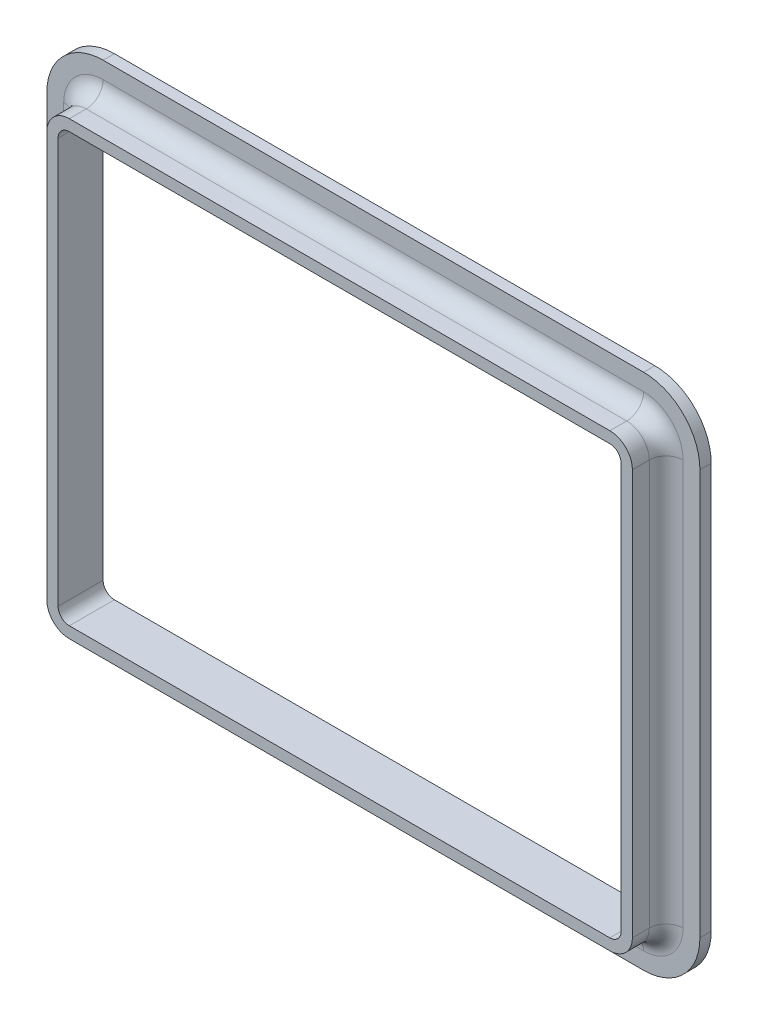
ISO-10303-21;
HEADER;
FILE_DESCRIPTION(('STEP AP214'),'2;1');
FILE_NAME('part.step','',(''),(''),'','','');
FILE_SCHEMA(('AUTOMOTIVE_DESIGN { 1 0 10303 214 1 1 1 1 }'));
ENDSEC;
DATA;
#1=APPLICATION_CONTEXT('core data for automotive mechanical design processes');
#2=APPLICATION_PROTOCOL_DEFINITION('international standard','automotive_design',2000,#1);
#3=PRODUCT_CONTEXT('',#1,'mechanical');
#4=PRODUCT('Part','Part','',(#3));
#5=PRODUCT_RELATED_PRODUCT_CATEGORY('part','',(#4));
#6=PRODUCT_DEFINITION_FORMATION('','',#4);
#7=PRODUCT_DEFINITION_CONTEXT('part definition',#1,'design');
#8=PRODUCT_DEFINITION('design','',#6,#7);
#9=PRODUCT_DEFINITION_SHAPE('','',#8);
#10=(LENGTH_UNIT() NAMED_UNIT(*) SI_UNIT(.MILLI.,.METRE.));
#11=(NAMED_UNIT(*) PLANE_ANGLE_UNIT() SI_UNIT($,.RADIAN.));
#12=(NAMED_UNIT(*) SI_UNIT($,.STERADIAN.) SOLID_ANGLE_UNIT());
#13=UNCERTAINTY_MEASURE_WITH_UNIT(LENGTH_MEASURE(1.E-05),#10,'distance_accuracy_value','');
#14=(GEOMETRIC_REPRESENTATION_CONTEXT(3) GLOBAL_UNCERTAINTY_ASSIGNED_CONTEXT((#13)) GLOBAL_UNIT_ASSIGNED_CONTEXT((#10,
#11,#12)) REPRESENTATION_CONTEXT('',''));
#15=CARTESIAN_POINT('',(0.,0.,0.));
#16=DIRECTION('',(0.,0.,1.));
#17=DIRECTION('',(1.,0.,0.));
#18=AXIS2_PLACEMENT_3D('',#15,#16,#17);
#19=CARTESIAN_POINT('',(-1.3,0.,0.6));
#20=DIRECTION('',(-1.,0.,0.));
#21=DIRECTION('',(0.,1.,0.));
#22=AXIS2_PLACEMENT_3D('',#19,#20,#21);
#23=PLANE('',#22);
#24=DIRECTION('',(0.,-1.,0.));
#25=VECTOR('',#24,1.);
#26=CARTESIAN_POINT('',(-1.3,0.,0.525));
#27=LINE('',#26,#25);
#28=CARTESIAN_POINT('',(-1.3,0.9,0.525));
#29=VERTEX_POINT('',#28);
#30=CARTESIAN_POINT('',(-1.3,-0.9,0.525));
#31=VERTEX_POINT('',#30);
#32=EDGE_CURVE('E11',#29,#31,#27,.T.);
#33=ORIENTED_EDGE('',*,*,#32,.T.);
#34=DIRECTION('',(0.,0.,-1.));
#35=VECTOR('',#34,1.);
#36=CARTESIAN_POINT('',(-1.3,-0.9,0.525));
#37=LINE('',#36,#35);
#38=CARTESIAN_POINT('',(-1.3,-0.9,0.6));
#39=VERTEX_POINT('',#38);
#40=EDGE_CURVE('E27',#39,#31,#37,.T.);
#41=ORIENTED_EDGE('',*,*,#40,.F.);
#42=DIRECTION('',(0.,-1.,0.));
#43=VECTOR('',#42,1.);
#44=CARTESIAN_POINT('',(-1.3,0.9,0.6));
#45=LINE('',#44,#43);
#46=CARTESIAN_POINT('',(-1.3,0.9,0.6));
#47=VERTEX_POINT('',#46);
#48=EDGE_CURVE('E437',#47,#39,#45,.T.);
#49=ORIENTED_EDGE('',*,*,#48,.F.);
#50=DIRECTION('',(0.,0.,-1.));
#51=VECTOR('',#50,1.);
#52=CARTESIAN_POINT('',(-1.3,0.9,0.525));
#53=LINE('',#52,#51);
#54=EDGE_CURVE('E286',#47,#29,#53,.T.);
#55=ORIENTED_EDGE('',*,*,#54,.T.);
#56=EDGE_LOOP('',(#33,#41,#49,#55));
#57=FACE_BOUND('',#56,.T.);
#58=ADVANCED_FACE('F16',(#57),#23,.T.);
#59=CARTESIAN_POINT('',(-1.375,0.,0.525));
#60=DIRECTION('',(0.,-1.,0.));
#61=DIRECTION('',(1.,0.,0.));
#62=AXIS2_PLACEMENT_3D('',#59,#60,#61);
#63=CYLINDRICAL_SURFACE('',#62,0.075);
#64=DIRECTION('',(0.,-1.,0.));
#65=VECTOR('',#64,1.);
#66=CARTESIAN_POINT('',(-1.375,0.9,0.45));
#67=LINE('',#66,#65);
#68=CARTESIAN_POINT('',(-1.375,0.9,0.45));
#69=VERTEX_POINT('',#68);
#70=CARTESIAN_POINT('',(-1.375,-0.9,0.45));
#71=VERTEX_POINT('',#70);
#72=EDGE_CURVE('E402',#69,#71,#67,.T.);
#73=ORIENTED_EDGE('',*,*,#72,.T.);
#74=CARTESIAN_POINT('',(-1.375,-0.9,0.525));
#75=DIRECTION('',(0.,1.,0.));
#76=DIRECTION('',(1.,0.,0.));
#77=AXIS2_PLACEMENT_3D('',#74,#75,#76);
#78=CIRCLE('',#77,0.075);
#79=EDGE_CURVE('E397',#31,#71,#78,.T.);
#80=ORIENTED_EDGE('',*,*,#79,.F.);
#81=ORIENTED_EDGE('',*,*,#32,.F.);
#82=CARTESIAN_POINT('',(-1.375,0.9,0.525));
#83=DIRECTION('',(0.,1.,0.));
#84=DIRECTION('',(1.,0.,0.));
#85=AXIS2_PLACEMENT_3D('',#82,#83,#84);
#86=CIRCLE('',#85,0.075);
#87=EDGE_CURVE('E294',#29,#69,#86,.T.);
#88=ORIENTED_EDGE('',*,*,#87,.T.);
#89=EDGE_LOOP('',(#73,#80,#81,#88));
#90=FACE_BOUND('',#89,.T.);
#91=ADVANCED_FACE('F632',(#90),#63,.F.);
#92=CARTESIAN_POINT('',(-1.45,0.,0.45));
#93=DIRECTION('',(-1.,0.,0.));
#94=DIRECTION('',(0.,1.,0.));
#95=AXIS2_PLACEMENT_3D('',#92,#93,#94);
#96=PLANE('',#95);
#97=DIRECTION('',(0.,-1.,0.));
#98=VECTOR('',#97,1.);
#99=CARTESIAN_POINT('',(-1.45,0.9,0.4));
#100=LINE('',#99,#98);
#101=CARTESIAN_POINT('',(-1.45,0.9,0.4));
#102=VERTEX_POINT('',#101);
#103=CARTESIAN_POINT('',(-1.45,-0.9,0.4));
#104=VERTEX_POINT('',#103);
#105=EDGE_CURVE('E518',#102,#104,#100,.T.);
#106=ORIENTED_EDGE('',*,*,#105,.T.);
#107=DIRECTION('',(0.,0.,-1.));
#108=VECTOR('',#107,1.);
#109=CARTESIAN_POINT('',(-1.45,-0.9,0.4));
#110=LINE('',#109,#108);
#111=CARTESIAN_POINT('',(-1.45,-0.9,0.45));
#112=VERTEX_POINT('',#111);
#113=EDGE_CURVE('E442',#112,#104,#110,.T.);
#114=ORIENTED_EDGE('',*,*,#113,.F.);
#115=DIRECTION('',(0.,-1.,0.));
#116=VECTOR('',#115,1.);
#117=CARTESIAN_POINT('',(-1.45,0.9,0.45));
#118=LINE('',#117,#116);
#119=CARTESIAN_POINT('',(-1.45,0.9,0.45));
#120=VERTEX_POINT('',#119);
#121=EDGE_CURVE('E356',#120,#112,#118,.T.);
#122=ORIENTED_EDGE('',*,*,#121,.F.);
#123=DIRECTION('',(0.,0.,-1.));
#124=VECTOR('',#123,1.);
#125=CARTESIAN_POINT('',(-1.45,0.9,0.4));
#126=LINE('',#125,#124);
#127=EDGE_CURVE('E311',#120,#102,#126,.T.);
#128=ORIENTED_EDGE('',*,*,#127,.T.);
#129=EDGE_LOOP('',(#106,#114,#122,#128));
#130=FACE_BOUND('',#129,.T.);
#131=ADVANCED_FACE('F623',(#130),#96,.T.);
#132=CARTESIAN_POINT('',(-1.25,0.,0.4));
#133=DIRECTION('',(1.,0.,0.));
#134=DIRECTION('',(0.,1.,0.));
#135=AXIS2_PLACEMENT_3D('',#132,#133,#134);
#136=PLANE('',#135);
#137=DIRECTION('',(0.,-1.,0.));
#138=VECTOR('',#137,1.);
#139=CARTESIAN_POINT('',(-1.25,0.9,0.6));
#140=LINE('',#139,#138);
#141=CARTESIAN_POINT('',(-1.25,0.9,0.6));
#142=VERTEX_POINT('',#141);
#143=CARTESIAN_POINT('',(-1.25,-0.9,0.6));
#144=VERTEX_POINT('',#143);
#145=EDGE_CURVE('E425',#142,#144,#140,.T.);
#146=ORIENTED_EDGE('',*,*,#145,.T.);
#147=DIRECTION('',(0.,0.,1.));
#148=VECTOR('',#147,1.);
#149=CARTESIAN_POINT('',(-1.25,-0.9,0.6));
#150=LINE('',#149,#148);
#151=CARTESIAN_POINT('',(-1.25,-0.9,0.4));
#152=VERTEX_POINT('',#151);
#153=EDGE_CURVE('E227',#152,#144,#150,.T.);
#154=ORIENTED_EDGE('',*,*,#153,.F.);
#155=DIRECTION('',(0.,-1.,0.));
#156=VECTOR('',#155,1.);
#157=CARTESIAN_POINT('',(-1.25,0.9,0.4));
#158=LINE('',#157,#156);
#159=CARTESIAN_POINT('',(-1.25,0.9,0.4));
#160=VERTEX_POINT('',#159);
#161=EDGE_CURVE('E390',#160,#152,#158,.T.);
#162=ORIENTED_EDGE('',*,*,#161,.F.);
#163=DIRECTION('',(0.,0.,1.));
#164=VECTOR('',#163,1.);
#165=CARTESIAN_POINT('',(-1.25,0.9,0.6));
#166=LINE('',#165,#164);
#167=EDGE_CURVE('E323',#160,#142,#166,.T.);
#168=ORIENTED_EDGE('',*,*,#167,.T.);
#169=EDGE_LOOP('',(#146,#154,#162,#168));
#170=FACE_BOUND('',#169,.T.);
#171=ADVANCED_FACE('F18',(#170),#136,.T.);
#172=CARTESIAN_POINT('',(-1.2,-0.9,0.5625));
#173=DIRECTION('',(0.,0.,1.));
#174=DIRECTION('',(-1.,0.,0.));
#175=AXIS2_PLACEMENT_3D('',#172,#173,#174);
#176=CYLINDRICAL_SURFACE('',#175,0.1);
#177=ORIENTED_EDGE('',*,*,#40,.T.);
#178=CARTESIAN_POINT('',(-1.2,-0.9,0.525));
#179=DIRECTION('',(0.,0.,1.));
#180=DIRECTION('',(-1.,0.,0.));
#181=AXIS2_PLACEMENT_3D('',#178,#179,#180);
#182=CIRCLE('',#181,0.1);
#183=CARTESIAN_POINT('',(-1.2,-1.,0.525));
#184=VERTEX_POINT('',#183);
#185=EDGE_CURVE('E359',#31,#184,#182,.T.);
#186=ORIENTED_EDGE('',*,*,#185,.T.);
#187=DIRECTION('',(0.,0.,-1.));
#188=VECTOR('',#187,1.);
#189=CARTESIAN_POINT('',(-1.2,-1.,0.525));
#190=LINE('',#189,#188);
#191=CARTESIAN_POINT('',(-1.2,-1.,0.6));
#192=VERTEX_POINT('',#191);
#193=EDGE_CURVE('E449',#192,#184,#190,.T.);
#194=ORIENTED_EDGE('',*,*,#193,.F.);
#195=CARTESIAN_POINT('',(-1.2,-0.9,0.6));
#196=DIRECTION('',(0.,0.,1.));
#197=DIRECTION('',(-1.,0.,0.));
#198=AXIS2_PLACEMENT_3D('',#195,#196,#197);
#199=CIRCLE('',#198,0.1);
#200=EDGE_CURVE('E433',#39,#192,#199,.T.);
#201=ORIENTED_EDGE('',*,*,#200,.F.);
#202=EDGE_LOOP('',(#177,#186,#194,#201));
#203=FACE_BOUND('',#202,.T.);
#204=ADVANCED_FACE('F622',(#203),#176,.T.);
#205=CARTESIAN_POINT('',(-1.2,-0.9,0.525));
#206=DIRECTION('',(0.,0.,1.));
#207=DIRECTION('',(1.,0.,0.));
#208=AXIS2_PLACEMENT_3D('',#205,#206,#207);
#209=TOROIDAL_SURFACE('',#208,0.175,0.075);
#210=ORIENTED_EDGE('',*,*,#79,.T.);
#211=CARTESIAN_POINT('',(-1.2,-0.9,0.45));
#212=DIRECTION('',(0.,0.,1.));
#213=DIRECTION('',(-1.,0.,0.));
#214=AXIS2_PLACEMENT_3D('',#211,#212,#213);
#215=CIRCLE('',#214,0.175);
#216=CARTESIAN_POINT('',(-1.2,-1.075,0.45));
#217=VERTEX_POINT('',#216);
#218=EDGE_CURVE('E355',#71,#217,#215,.T.);
#219=ORIENTED_EDGE('',*,*,#218,.T.);
#220=CARTESIAN_POINT('',(-1.2,-1.075,0.525));
#221=DIRECTION('',(-1.,0.,0.));
#222=DIRECTION('',(0.,1.,0.));
#223=AXIS2_PLACEMENT_3D('',#220,#221,#222);
#224=CIRCLE('',#223,0.075);
#225=EDGE_CURVE('E315',#184,#217,#224,.T.);
#226=ORIENTED_EDGE('',*,*,#225,.F.);
#227=ORIENTED_EDGE('',*,*,#185,.F.);
#228=EDGE_LOOP('',(#210,#219,#226,#227));
#229=FACE_BOUND('',#228,.T.);
#230=ADVANCED_FACE('F629',(#229),#209,.F.);
#231=CARTESIAN_POINT('',(-1.2,-0.9,0.425));
#232=DIRECTION('',(0.,0.,1.));
#233=DIRECTION('',(-1.,0.,0.));
#234=AXIS2_PLACEMENT_3D('',#231,#232,#233);
#235=CYLINDRICAL_SURFACE('',#234,0.25);
#236=ORIENTED_EDGE('',*,*,#113,.T.);
#237=CARTESIAN_POINT('',(-1.2,-0.9,0.4));
#238=DIRECTION('',(0.,0.,1.));
#239=DIRECTION('',(-1.,0.,0.));
#240=AXIS2_PLACEMENT_3D('',#237,#238,#239);
#241=CIRCLE('',#240,0.25);
#242=CARTESIAN_POINT('',(-1.2,-1.15,0.4));
#243=VERTEX_POINT('',#242);
#244=EDGE_CURVE('E522',#104,#243,#241,.T.);
#245=ORIENTED_EDGE('',*,*,#244,.T.);
#246=DIRECTION('',(0.,0.,-1.));
#247=VECTOR('',#246,1.);
#248=CARTESIAN_POINT('',(-1.2,-1.15,0.4));
#249=LINE('',#248,#247);
#250=CARTESIAN_POINT('',(-1.2,-1.15,0.45));
#251=VERTEX_POINT('',#250);
#252=EDGE_CURVE('E217',#251,#243,#249,.T.);
#253=ORIENTED_EDGE('',*,*,#252,.F.);
#254=CARTESIAN_POINT('',(-1.2,-0.9,0.45));
#255=DIRECTION('',(0.,0.,1.));
#256=DIRECTION('',(-1.,0.,0.));
#257=AXIS2_PLACEMENT_3D('',#254,#255,#256);
#258=CIRCLE('',#257,0.25);
#259=EDGE_CURVE('E352',#112,#251,#258,.T.);
#260=ORIENTED_EDGE('',*,*,#259,.F.);
#261=EDGE_LOOP('',(#236,#245,#253,#260));
#262=FACE_BOUND('',#261,.T.);
#263=ADVANCED_FACE('F643',(#262),#235,.T.);
#264=CARTESIAN_POINT('',(-1.2,-0.9,0.5));
#265=DIRECTION('',(0.,0.,1.));
#266=DIRECTION('',(-1.,0.,0.));
#267=AXIS2_PLACEMENT_3D('',#264,#265,#266);
#268=CYLINDRICAL_SURFACE('',#267,0.05);
#269=ORIENTED_EDGE('',*,*,#153,.T.);
#270=CARTESIAN_POINT('',(-1.2,-0.9,0.6));
#271=DIRECTION('',(0.,0.,1.));
#272=DIRECTION('',(-1.,0.,0.));
#273=AXIS2_PLACEMENT_3D('',#270,#271,#272);
#274=CIRCLE('',#273,0.05);
#275=CARTESIAN_POINT('',(-1.2,-0.95,0.6));
#276=VERTEX_POINT('',#275);
#277=EDGE_CURVE('E428',#144,#276,#274,.T.);
#278=ORIENTED_EDGE('',*,*,#277,.T.);
#279=DIRECTION('',(0.,0.,1.));
#280=VECTOR('',#279,1.);
#281=CARTESIAN_POINT('',(-1.2,-0.95,0.6));
#282=LINE('',#281,#280);
#283=CARTESIAN_POINT('',(-1.2,-0.95,0.4));
#284=VERTEX_POINT('',#283);
#285=EDGE_CURVE('E338',#284,#276,#282,.T.);
#286=ORIENTED_EDGE('',*,*,#285,.F.);
#287=CARTESIAN_POINT('',(-1.2,-0.9,0.4));
#288=DIRECTION('',(0.,0.,1.));
#289=DIRECTION('',(-1.,0.,0.));
#290=AXIS2_PLACEMENT_3D('',#287,#288,#289);
#291=CIRCLE('',#290,0.05);
#292=EDGE_CURVE('E345',#152,#284,#291,.T.);
#293=ORIENTED_EDGE('',*,*,#292,.F.);
#294=EDGE_LOOP('',(#269,#278,#286,#293));
#295=FACE_BOUND('',#294,.T.);
#296=ADVANCED_FACE('F596',(#295),#268,.F.);
#297=CARTESIAN_POINT('',(-1.2,-1.,0.6));
#298=DIRECTION('',(0.,-1.,0.));
#299=DIRECTION('',(0.,0.,-1.));
#300=AXIS2_PLACEMENT_3D('',#297,#298,#299);
#301=PLANE('',#300);
#302=ORIENTED_EDGE('',*,*,#193,.T.);
#303=DIRECTION('',(1.,0.,0.));
#304=VECTOR('',#303,1.);
#305=CARTESIAN_POINT('',(-1.2,-1.,0.525));
#306=LINE('',#305,#304);
#307=CARTESIAN_POINT('',(1.2,-1.,0.525));
#308=VERTEX_POINT('',#307);
#309=EDGE_CURVE('E465',#184,#308,#306,.T.);
#310=ORIENTED_EDGE('',*,*,#309,.T.);
#311=DIRECTION('',(0.,0.,-1.));
#312=VECTOR('',#311,1.);
#313=CARTESIAN_POINT('',(1.2,-1.,0.525));
#314=LINE('',#313,#312);
#315=CARTESIAN_POINT('',(1.2,-1.,0.6));
#316=VERTEX_POINT('',#315);
#317=EDGE_CURVE('E365',#316,#308,#314,.T.);
#318=ORIENTED_EDGE('',*,*,#317,.F.);
#319=DIRECTION('',(1.,0.,0.));
#320=VECTOR('',#319,1.);
#321=CARTESIAN_POINT('',(-1.2,-1.,0.6));
#322=LINE('',#321,#320);
#323=EDGE_CURVE('E480',#192,#316,#322,.T.);
#324=ORIENTED_EDGE('',*,*,#323,.F.);
#325=EDGE_LOOP('',(#302,#310,#318,#324));
#326=FACE_BOUND('',#325,.T.);
#327=ADVANCED_FACE('F677',(#326),#301,.T.);
#328=CARTESIAN_POINT('',(-1.2,-1.075,0.525));
#329=DIRECTION('',(1.,0.,0.));
#330=DIRECTION('',(0.,1.,0.));
#331=AXIS2_PLACEMENT_3D('',#328,#329,#330);
#332=CYLINDRICAL_SURFACE('',#331,0.075);
#333=ORIENTED_EDGE('',*,*,#225,.T.);
#334=DIRECTION('',(1.,0.,0.));
#335=VECTOR('',#334,1.);
#336=CARTESIAN_POINT('',(-1.2,-1.075,0.45));
#337=LINE('',#336,#335);
#338=CARTESIAN_POINT('',(1.2,-1.075,0.45));
#339=VERTEX_POINT('',#338);
#340=EDGE_CURVE('E405',#217,#339,#337,.T.);
#341=ORIENTED_EDGE('',*,*,#340,.T.);
#342=CARTESIAN_POINT('',(1.2,-1.075,0.525));
#343=DIRECTION('',(-1.,0.,0.));
#344=DIRECTION('',(0.,1.,0.));
#345=AXIS2_PLACEMENT_3D('',#342,#343,#344);
#346=CIRCLE('',#345,0.075);
#347=EDGE_CURVE('E460',#308,#339,#346,.T.);
#348=ORIENTED_EDGE('',*,*,#347,.F.);
#349=ORIENTED_EDGE('',*,*,#309,.F.);
#350=EDGE_LOOP('',(#333,#341,#348,#349));
#351=FACE_BOUND('',#350,.T.);
#352=ADVANCED_FACE('F1134',(#351),#332,.F.);
#353=CARTESIAN_POINT('',(-1.2,-1.075,0.45));
#354=DIRECTION('',(0.,0.,1.));
#355=DIRECTION('',(0.,-1.,0.));
#356=AXIS2_PLACEMENT_3D('',#353,#354,#355);
#357=PLANE('',#356);
#358=ORIENTED_EDGE('',*,*,#218,.F.);
#359=ORIENTED_EDGE('',*,*,#72,.F.);
#360=CARTESIAN_POINT('',(-1.2,0.9,0.45));
#361=DIRECTION('',(0.,0.,1.));
#362=DIRECTION('',(0.,1.,0.));
#363=AXIS2_PLACEMENT_3D('',#360,#361,#362);
#364=CIRCLE('',#363,0.175);
#365=CARTESIAN_POINT('',(-1.2,1.075,0.45));
#366=VERTEX_POINT('',#365);
#367=EDGE_CURVE('E301',#366,#69,#364,.T.);
#368=ORIENTED_EDGE('',*,*,#367,.F.);
#369=DIRECTION('',(-1.,0.,0.));
#370=VECTOR('',#369,1.);
#371=CARTESIAN_POINT('',(1.2,1.075,0.45));
#372=LINE('',#371,#370);
#373=CARTESIAN_POINT('',(1.2,1.075,0.45));
#374=VERTEX_POINT('',#373);
#375=EDGE_CURVE('E273',#374,#366,#372,.T.);
#376=ORIENTED_EDGE('',*,*,#375,.F.);
#377=CARTESIAN_POINT('',(1.2,0.9,0.45));
#378=DIRECTION('',(0.,0.,1.));
#379=DIRECTION('',(1.,0.,0.));
#380=AXIS2_PLACEMENT_3D('',#377,#378,#379);
#381=CIRCLE('',#380,0.175);
#382=CARTESIAN_POINT('',(1.375,0.9,0.45));
#383=VERTEX_POINT('',#382);
#384=EDGE_CURVE('E321',#383,#374,#381,.T.);
#385=ORIENTED_EDGE('',*,*,#384,.F.);
#386=DIRECTION('',(0.,1.,0.));
#387=VECTOR('',#386,1.);
#388=CARTESIAN_POINT('',(1.375,-0.9,0.45));
#389=LINE('',#388,#387);
#390=CARTESIAN_POINT('',(1.375,-0.9,0.45));
#391=VERTEX_POINT('',#390);
#392=EDGE_CURVE('E332',#391,#383,#389,.T.);
#393=ORIENTED_EDGE('',*,*,#392,.F.);
#394=CARTESIAN_POINT('',(1.2,-0.9,0.45));
#395=DIRECTION('',(0.,0.,1.));
#396=DIRECTION('',(0.,-1.,0.));
#397=AXIS2_PLACEMENT_3D('',#394,#395,#396);
#398=CIRCLE('',#397,0.175);
#399=EDGE_CURVE('E497',#339,#391,#398,.T.);
#400=ORIENTED_EDGE('',*,*,#399,.F.);
#401=ORIENTED_EDGE('',*,*,#340,.F.);
#402=EDGE_LOOP('',(#358,#359,#368,#376,#385,#393,#400,#401));
#403=FACE_BOUND('',#402,.T.);
#404=DIRECTION('',(1.,0.,0.));
#405=VECTOR('',#404,1.);
#406=CARTESIAN_POINT('',(-1.2,-1.15,0.45));
#407=LINE('',#406,#405);
#408=CARTESIAN_POINT('',(1.2,-1.15,0.45));
#409=VERTEX_POINT('',#408);
#410=EDGE_CURVE('E344',#251,#409,#407,.T.);
#411=ORIENTED_EDGE('',*,*,#410,.T.);
#412=CARTESIAN_POINT('',(1.2,-0.9,0.45));
#413=DIRECTION('',(0.,0.,1.));
#414=DIRECTION('',(0.,-1.,0.));
#415=AXIS2_PLACEMENT_3D('',#412,#413,#414);
#416=CIRCLE('',#415,0.25);
#417=CARTESIAN_POINT('',(1.45,-0.9,0.45));
#418=VERTEX_POINT('',#417);
#419=EDGE_CURVE('E457',#409,#418,#416,.T.);
#420=ORIENTED_EDGE('',*,*,#419,.T.);
#421=DIRECTION('',(0.,1.,0.));
#422=VECTOR('',#421,1.);
#423=CARTESIAN_POINT('',(1.45,-0.9,0.45));
#424=LINE('',#423,#422);
#425=CARTESIAN_POINT('',(1.45,0.9,0.45));
#426=VERTEX_POINT('',#425);
#427=EDGE_CURVE('E363',#418,#426,#424,.T.);
#428=ORIENTED_EDGE('',*,*,#427,.T.);
#429=CARTESIAN_POINT('',(1.2,0.9,0.45));
#430=DIRECTION('',(0.,0.,1.));
#431=DIRECTION('',(1.,0.,0.));
#432=AXIS2_PLACEMENT_3D('',#429,#430,#431);
#433=CIRCLE('',#432,0.25);
#434=CARTESIAN_POINT('',(1.2,1.15,0.45));
#435=VERTEX_POINT('',#434);
#436=EDGE_CURVE('E322',#426,#435,#433,.T.);
#437=ORIENTED_EDGE('',*,*,#436,.T.);
#438=DIRECTION('',(-1.,0.,0.));
#439=VECTOR('',#438,1.);
#440=CARTESIAN_POINT('',(1.2,1.15,0.45));
#441=LINE('',#440,#439);
#442=CARTESIAN_POINT('',(-1.2,1.15,0.45));
#443=VERTEX_POINT('',#442);
#444=EDGE_CURVE('E375',#435,#443,#441,.T.);
#445=ORIENTED_EDGE('',*,*,#444,.T.);
#446=CARTESIAN_POINT('',(-1.2,0.9,0.45));
#447=DIRECTION('',(0.,0.,1.));
#448=DIRECTION('',(0.,1.,0.));
#449=AXIS2_PLACEMENT_3D('',#446,#447,#448);
#450=CIRCLE('',#449,0.25);
#451=EDGE_CURVE('E302',#443,#120,#450,.T.);
#452=ORIENTED_EDGE('',*,*,#451,.T.);
#453=ORIENTED_EDGE('',*,*,#121,.T.);
#454=ORIENTED_EDGE('',*,*,#259,.T.);
#455=EDGE_LOOP('',(#411,#420,#428,#437,#445,#452,#453,#454));
#456=FACE_BOUND('',#455,.T.);
#457=ADVANCED_FACE('F682',(#403,#456),#357,.T.);
#458=CARTESIAN_POINT('',(-1.2,-1.15,0.45));
#459=DIRECTION('',(0.,-1.,0.));
#460=DIRECTION('',(0.,0.,-1.));
#461=AXIS2_PLACEMENT_3D('',#458,#459,#460);
#462=PLANE('',#461);
#463=ORIENTED_EDGE('',*,*,#252,.T.);
#464=DIRECTION('',(1.,0.,0.));
#465=VECTOR('',#464,1.);
#466=CARTESIAN_POINT('',(-1.2,-1.15,0.4));
#467=LINE('',#466,#465);
#468=CARTESIAN_POINT('',(1.2,-1.15,0.4));
#469=VERTEX_POINT('',#468);
#470=EDGE_CURVE('E394',#243,#469,#467,.T.);
#471=ORIENTED_EDGE('',*,*,#470,.T.);
#472=DIRECTION('',(0.,0.,-1.));
#473=VECTOR('',#472,1.);
#474=CARTESIAN_POINT('',(1.2,-1.15,0.4));
#475=LINE('',#474,#473);
#476=EDGE_CURVE('E346',#409,#469,#475,.T.);
#477=ORIENTED_EDGE('',*,*,#476,.F.);
#478=ORIENTED_EDGE('',*,*,#410,.F.);
#479=EDGE_LOOP('',(#463,#471,#477,#478));
#480=FACE_BOUND('',#479,.T.);
#481=ADVANCED_FACE('F680',(#480),#462,.T.);
#482=CARTESIAN_POINT('',(-1.2,-1.15,0.4));
#483=DIRECTION('',(0.,0.,-1.));
#484=DIRECTION('',(0.,-1.,0.));
#485=AXIS2_PLACEMENT_3D('',#482,#483,#484);
#486=PLANE('',#485);
#487=DIRECTION('',(1.,0.,0.));
#488=VECTOR('',#487,1.);
#489=CARTESIAN_POINT('',(-1.2,-0.95,0.4));
#490=LINE('',#489,#488);
#491=CARTESIAN_POINT('',(1.2,-0.95,0.4));
#492=VERTEX_POINT('',#491);
#493=EDGE_CURVE('E20',#284,#492,#490,.T.);
#494=ORIENTED_EDGE('',*,*,#493,.T.);
#495=CARTESIAN_POINT('',(1.2,-0.9,0.4));
#496=DIRECTION('',(0.,0.,1.));
#497=DIRECTION('',(0.,-1.,0.));
#498=AXIS2_PLACEMENT_3D('',#495,#496,#497);
#499=CIRCLE('',#498,0.05);
#500=CARTESIAN_POINT('',(1.25,-0.9,0.4));
#501=VERTEX_POINT('',#500);
#502=EDGE_CURVE('E351',#492,#501,#499,.T.);
#503=ORIENTED_EDGE('',*,*,#502,.T.);
#504=DIRECTION('',(0.,1.,0.));
#505=VECTOR('',#504,1.);
#506=CARTESIAN_POINT('',(1.25,-0.9,0.4));
#507=LINE('',#506,#505);
#508=CARTESIAN_POINT('',(1.25,0.9,0.4));
#509=VERTEX_POINT('',#508);
#510=EDGE_CURVE('E432',#501,#509,#507,.T.);
#511=ORIENTED_EDGE('',*,*,#510,.T.);
#512=CARTESIAN_POINT('',(1.2,0.9,0.4));
#513=DIRECTION('',(0.,0.,1.));
#514=DIRECTION('',(1.,0.,0.));
#515=AXIS2_PLACEMENT_3D('',#512,#513,#514);
#516=CIRCLE('',#515,0.05);
#517=CARTESIAN_POINT('',(1.2,0.95,0.4));
#518=VERTEX_POINT('',#517);
#519=EDGE_CURVE('E385',#509,#518,#516,.T.);
#520=ORIENTED_EDGE('',*,*,#519,.T.);
#521=DIRECTION('',(-1.,0.,0.));
#522=VECTOR('',#521,1.);
#523=CARTESIAN_POINT('',(1.2,0.95,0.4));
#524=LINE('',#523,#522);
#525=CARTESIAN_POINT('',(-1.2,0.95,0.4));
#526=VERTEX_POINT('',#525);
#527=EDGE_CURVE('E92',#518,#526,#524,.T.);
#528=ORIENTED_EDGE('',*,*,#527,.T.);
#529=CARTESIAN_POINT('',(-1.2,0.9,0.4));
#530=DIRECTION('',(0.,0.,1.));
#531=DIRECTION('',(0.,1.,0.));
#532=AXIS2_PLACEMENT_3D('',#529,#530,#531);
#533=CIRCLE('',#532,0.0499999999999992);
#534=EDGE_CURVE('E327',#526,#160,#533,.T.);
#535=ORIENTED_EDGE('',*,*,#534,.T.);
#536=ORIENTED_EDGE('',*,*,#161,.T.);
#537=ORIENTED_EDGE('',*,*,#292,.T.);
#538=EDGE_LOOP('',(#494,#503,#511,#520,#528,#535,#536,#537));
#539=FACE_BOUND('',#538,.T.);
#540=ORIENTED_EDGE('',*,*,#244,.F.);
#541=ORIENTED_EDGE('',*,*,#105,.F.);
#542=CARTESIAN_POINT('',(-1.2,0.9,0.4));
#543=DIRECTION('',(0.,0.,1.));
#544=DIRECTION('',(0.,1.,0.));
#545=AXIS2_PLACEMENT_3D('',#542,#543,#544);
#546=CIRCLE('',#545,0.25);
#547=CARTESIAN_POINT('',(-1.2,1.15,0.4));
#548=VERTEX_POINT('',#547);
#549=EDGE_CURVE('E389',#548,#102,#546,.T.);
#550=ORIENTED_EDGE('',*,*,#549,.F.);
#551=DIRECTION('',(-1.,0.,0.));
#552=VECTOR('',#551,1.);
#553=CARTESIAN_POINT('',(1.2,1.15,0.4));
#554=LINE('',#553,#552);
#555=CARTESIAN_POINT('',(1.2,1.15,0.4));
#556=VERTEX_POINT('',#555);
#557=EDGE_CURVE('E379',#556,#548,#554,.T.);
#558=ORIENTED_EDGE('',*,*,#557,.F.);
#559=CARTESIAN_POINT('',(1.2,0.9,0.4));
#560=DIRECTION('',(0.,0.,1.));
#561=DIRECTION('',(1.,0.,0.));
#562=AXIS2_PLACEMENT_3D('',#559,#560,#561);
#563=CIRCLE('',#562,0.25);
#564=CARTESIAN_POINT('',(1.45,0.9,0.4));
#565=VERTEX_POINT('',#564);
#566=EDGE_CURVE('E384',#565,#556,#563,.T.);
#567=ORIENTED_EDGE('',*,*,#566,.F.);
#568=DIRECTION('',(0.,1.,0.));
#569=VECTOR('',#568,1.);
#570=CARTESIAN_POINT('',(1.45,-0.9,0.4));
#571=LINE('',#570,#569);
#572=CARTESIAN_POINT('',(1.45,-0.9,0.4));
#573=VERTEX_POINT('',#572);
#574=EDGE_CURVE('E360',#573,#565,#571,.T.);
#575=ORIENTED_EDGE('',*,*,#574,.F.);
#576=CARTESIAN_POINT('',(1.2,-0.9,0.4));
#577=DIRECTION('',(0.,0.,1.));
#578=DIRECTION('',(0.,-1.,0.));
#579=AXIS2_PLACEMENT_3D('',#576,#577,#578);
#580=CIRCLE('',#579,0.25);
#581=EDGE_CURVE('E350',#469,#573,#580,.T.);
#582=ORIENTED_EDGE('',*,*,#581,.F.);
#583=ORIENTED_EDGE('',*,*,#470,.F.);
#584=EDGE_LOOP('',(#540,#541,#550,#558,#567,#575,#582,#583));
#585=FACE_BOUND('',#584,.T.);
#586=ADVANCED_FACE('F586',(#539,#585),#486,.T.);
#587=CARTESIAN_POINT('',(-1.2,-0.95,0.4));
#588=DIRECTION('',(0.,1.,0.));
#589=DIRECTION('',(1.,0.,0.));
#590=AXIS2_PLACEMENT_3D('',#587,#588,#589);
#591=PLANE('',#590);
#592=ORIENTED_EDGE('',*,*,#285,.T.);
#593=DIRECTION('',(1.,0.,0.));
#594=VECTOR('',#593,1.);
#595=CARTESIAN_POINT('',(-1.2,-0.95,0.6));
#596=LINE('',#595,#594);
#597=CARTESIAN_POINT('',(1.2,-0.95,0.6));
#598=VERTEX_POINT('',#597);
#599=EDGE_CURVE('E341',#276,#598,#596,.T.);
#600=ORIENTED_EDGE('',*,*,#599,.T.);
#601=DIRECTION('',(0.,0.,1.));
#602=VECTOR('',#601,1.);
#603=CARTESIAN_POINT('',(1.2,-0.95,0.6));
#604=LINE('',#603,#602);
#605=EDGE_CURVE('E475',#492,#598,#604,.T.);
#606=ORIENTED_EDGE('',*,*,#605,.F.);
#607=ORIENTED_EDGE('',*,*,#493,.F.);
#608=EDGE_LOOP('',(#592,#600,#606,#607));
#609=FACE_BOUND('',#608,.T.);
#610=ADVANCED_FACE('F593',(#609),#591,.T.);
#611=CARTESIAN_POINT('',(-1.2,-0.95,0.6));
#612=DIRECTION('',(0.,0.,1.));
#613=DIRECTION('',(1.,0.,0.));
#614=AXIS2_PLACEMENT_3D('',#611,#612,#613);
#615=PLANE('',#614);
#616=ORIENTED_EDGE('',*,*,#277,.F.);
#617=ORIENTED_EDGE('',*,*,#145,.F.);
#618=CARTESIAN_POINT('',(-1.2,0.9,0.6));
#619=DIRECTION('',(0.,0.,1.));
#620=DIRECTION('',(0.,1.,0.));
#621=AXIS2_PLACEMENT_3D('',#618,#619,#620);
#622=CIRCLE('',#621,0.0499999999999992);
#623=CARTESIAN_POINT('',(-1.2,0.95,0.6));
#624=VERTEX_POINT('',#623);
#625=EDGE_CURVE('E328',#624,#142,#622,.T.);
#626=ORIENTED_EDGE('',*,*,#625,.F.);
#627=DIRECTION('',(-1.,0.,0.));
#628=VECTOR('',#627,1.);
#629=CARTESIAN_POINT('',(1.2,0.95,0.6));
#630=LINE('',#629,#628);
#631=CARTESIAN_POINT('',(1.2,0.95,0.6));
#632=VERTEX_POINT('',#631);
#633=EDGE_CURVE('E76',#632,#624,#630,.T.);
#634=ORIENTED_EDGE('',*,*,#633,.F.);
#635=CARTESIAN_POINT('',(1.2,0.9,0.6));
#636=DIRECTION('',(0.,0.,1.));
#637=DIRECTION('',(1.,0.,0.));
#638=AXIS2_PLACEMENT_3D('',#635,#636,#637);
#639=CIRCLE('',#638,0.05);
#640=CARTESIAN_POINT('',(1.25,0.9,0.6));
#641=VERTEX_POINT('',#640);
#642=EDGE_CURVE('E450',#641,#632,#639,.T.);
#643=ORIENTED_EDGE('',*,*,#642,.F.);
#644=DIRECTION('',(0.,1.,0.));
#645=VECTOR('',#644,1.);
#646=CARTESIAN_POINT('',(1.25,-0.9,0.6));
#647=LINE('',#646,#645);
#648=CARTESIAN_POINT('',(1.25,-0.9,0.6));
#649=VERTEX_POINT('',#648);
#650=EDGE_CURVE('E491',#649,#641,#647,.T.);
#651=ORIENTED_EDGE('',*,*,#650,.F.);
#652=CARTESIAN_POINT('',(1.2,-0.9,0.6));
#653=DIRECTION('',(0.,0.,1.));
#654=DIRECTION('',(0.,-1.,0.));
#655=AXIS2_PLACEMENT_3D('',#652,#653,#654);
#656=CIRCLE('',#655,0.05);
#657=EDGE_CURVE('E529',#598,#649,#656,.T.);
#658=ORIENTED_EDGE('',*,*,#657,.F.);
#659=ORIENTED_EDGE('',*,*,#599,.F.);
#660=EDGE_LOOP('',(#616,#617,#626,#634,#643,#651,#658,#659));
#661=FACE_BOUND('',#660,.T.);
#662=ORIENTED_EDGE('',*,*,#323,.T.);
#663=CARTESIAN_POINT('',(1.2,-0.9,0.6));
#664=DIRECTION('',(0.,0.,1.));
#665=DIRECTION('',(0.,-1.,0.));
#666=AXIS2_PLACEMENT_3D('',#663,#664,#665);
#667=CIRCLE('',#666,0.1);
#668=CARTESIAN_POINT('',(1.3,-0.9,0.6));
#669=VERTEX_POINT('',#668);
#670=EDGE_CURVE('E369',#316,#669,#667,.T.);
#671=ORIENTED_EDGE('',*,*,#670,.T.);
#672=DIRECTION('',(0.,1.,0.));
#673=VECTOR('',#672,1.);
#674=CARTESIAN_POINT('',(1.3,-0.9,0.6));
#675=LINE('',#674,#673);
#676=CARTESIAN_POINT('',(1.3,0.9,0.6));
#677=VERTEX_POINT('',#676);
#678=EDGE_CURVE('E471',#669,#677,#675,.T.);
#679=ORIENTED_EDGE('',*,*,#678,.T.);
#680=CARTESIAN_POINT('',(1.2,0.9,0.6));
#681=DIRECTION('',(0.,0.,1.));
#682=DIRECTION('',(1.,0.,0.));
#683=AXIS2_PLACEMENT_3D('',#680,#681,#682);
#684=CIRCLE('',#683,0.1);
#685=CARTESIAN_POINT('',(1.2,1.,0.6));
#686=VERTEX_POINT('',#685);
#687=EDGE_CURVE('E398',#677,#686,#684,.T.);
#688=ORIENTED_EDGE('',*,*,#687,.T.);
#689=DIRECTION('',(-1.,0.,0.));
#690=VECTOR('',#689,1.);
#691=CARTESIAN_POINT('',(1.2,1.,0.6));
#692=LINE('',#691,#690);
#693=CARTESIAN_POINT('',(-1.2,1.,0.6));
#694=VERTEX_POINT('',#693);
#695=EDGE_CURVE('E488',#686,#694,#692,.T.);
#696=ORIENTED_EDGE('',*,*,#695,.T.);
#697=CARTESIAN_POINT('',(-1.2,0.9,0.6));
#698=DIRECTION('',(0.,0.,1.));
#699=DIRECTION('',(0.,1.,0.));
#700=AXIS2_PLACEMENT_3D('',#697,#698,#699);
#701=CIRCLE('',#700,0.1);
#702=EDGE_CURVE('E284',#694,#47,#701,.T.);
#703=ORIENTED_EDGE('',*,*,#702,.T.);
#704=ORIENTED_EDGE('',*,*,#48,.T.);
#705=ORIENTED_EDGE('',*,*,#200,.T.);
#706=EDGE_LOOP('',(#662,#671,#679,#688,#696,#703,#704,#705));
#707=FACE_BOUND('',#706,.T.);
#708=ADVANCED_FACE('F599',(#661,#707),#615,.T.);
#709=CARTESIAN_POINT('',(1.2,-0.9,0.5625));
#710=DIRECTION('',(0.,0.,1.));
#711=DIRECTION('',(0.,-1.,0.));
#712=AXIS2_PLACEMENT_3D('',#709,#710,#711);
#713=CYLINDRICAL_SURFACE('',#712,0.1);
#714=ORIENTED_EDGE('',*,*,#317,.T.);
#715=CARTESIAN_POINT('',(1.2,-0.9,0.525));
#716=DIRECTION('',(0.,0.,1.));
#717=DIRECTION('',(0.,-1.,0.));
#718=AXIS2_PLACEMENT_3D('',#715,#716,#717);
#719=CIRCLE('',#718,0.1);
#720=CARTESIAN_POINT('',(1.3,-0.9,0.525));
#721=VERTEX_POINT('',#720);
#722=EDGE_CURVE('E370',#308,#721,#719,.T.);
#723=ORIENTED_EDGE('',*,*,#722,.T.);
#724=DIRECTION('',(0.,0.,-1.));
#725=VECTOR('',#724,1.);
#726=CARTESIAN_POINT('',(1.3,-0.9,0.525));
#727=LINE('',#726,#725);
#728=EDGE_CURVE('E476',#669,#721,#727,.T.);
#729=ORIENTED_EDGE('',*,*,#728,.F.);
#730=ORIENTED_EDGE('',*,*,#670,.F.);
#731=EDGE_LOOP('',(#714,#723,#729,#730));
#732=FACE_BOUND('',#731,.T.);
#733=ADVANCED_FACE('F666',(#732),#713,.T.);
#734=CARTESIAN_POINT('',(1.2,-0.9,0.525));
#735=DIRECTION('',(0.,0.,1.));
#736=DIRECTION('',(1.,0.,0.));
#737=AXIS2_PLACEMENT_3D('',#734,#735,#736);
#738=TOROIDAL_SURFACE('',#737,0.175,0.075);
#739=ORIENTED_EDGE('',*,*,#347,.T.);
#740=ORIENTED_EDGE('',*,*,#399,.T.);
#741=CARTESIAN_POINT('',(1.375,-0.9,0.525));
#742=DIRECTION('',(0.,-1.,0.));
#743=DIRECTION('',(-1.,0.,0.));
#744=AXIS2_PLACEMENT_3D('',#741,#742,#743);
#745=CIRCLE('',#744,0.075);
#746=EDGE_CURVE('E337',#721,#391,#745,.T.);
#747=ORIENTED_EDGE('',*,*,#746,.F.);
#748=ORIENTED_EDGE('',*,*,#722,.F.);
#749=EDGE_LOOP('',(#739,#740,#747,#748));
#750=FACE_BOUND('',#749,.T.);
#751=ADVANCED_FACE('F662',(#750),#738,.F.);
#752=CARTESIAN_POINT('',(1.2,-0.9,0.425));
#753=DIRECTION('',(0.,0.,1.));
#754=DIRECTION('',(0.,-1.,0.));
#755=AXIS2_PLACEMENT_3D('',#752,#753,#754);
#756=CYLINDRICAL_SURFACE('',#755,0.25);
#757=ORIENTED_EDGE('',*,*,#476,.T.);
#758=ORIENTED_EDGE('',*,*,#581,.T.);
#759=DIRECTION('',(0.,0.,-1.));
#760=VECTOR('',#759,1.);
#761=CARTESIAN_POINT('',(1.45,-0.9,0.4));
#762=LINE('',#761,#760);
#763=EDGE_CURVE('E364',#418,#573,#762,.T.);
#764=ORIENTED_EDGE('',*,*,#763,.F.);
#765=ORIENTED_EDGE('',*,*,#419,.F.);
#766=EDGE_LOOP('',(#757,#758,#764,#765));
#767=FACE_BOUND('',#766,.T.);
#768=ADVANCED_FACE('F665',(#767),#756,.T.);
#769=CARTESIAN_POINT('',(1.2,-0.9,0.5));
#770=DIRECTION('',(0.,0.,1.));
#771=DIRECTION('',(0.,-1.,0.));
#772=AXIS2_PLACEMENT_3D('',#769,#770,#771);
#773=CYLINDRICAL_SURFACE('',#772,0.05);
#774=ORIENTED_EDGE('',*,*,#605,.T.);
#775=ORIENTED_EDGE('',*,*,#657,.T.);
#776=DIRECTION('',(0.,0.,1.));
#777=VECTOR('',#776,1.);
#778=CARTESIAN_POINT('',(1.25,-0.9,0.6));
#779=LINE('',#778,#777);
#780=EDGE_CURVE('E400',#501,#649,#779,.T.);
#781=ORIENTED_EDGE('',*,*,#780,.F.);
#782=ORIENTED_EDGE('',*,*,#502,.F.);
#783=EDGE_LOOP('',(#774,#775,#781,#782));
#784=FACE_BOUND('',#783,.T.);
#785=ADVANCED_FACE('F606',(#784),#773,.F.);
#786=CARTESIAN_POINT('',(1.3,-0.9,0.6));
#787=DIRECTION('',(1.,0.,0.));
#788=DIRECTION('',(0.,1.,0.));
#789=AXIS2_PLACEMENT_3D('',#786,#787,#788);
#790=PLANE('',#789);
#791=ORIENTED_EDGE('',*,*,#728,.T.);
#792=DIRECTION('',(0.,1.,0.));
#793=VECTOR('',#792,1.);
#794=CARTESIAN_POINT('',(1.3,-0.9,0.525));
#795=LINE('',#794,#793);
#796=CARTESIAN_POINT('',(1.3,0.9,0.525));
#797=VERTEX_POINT('',#796);
#798=EDGE_CURVE('E336',#721,#797,#795,.T.);
#799=ORIENTED_EDGE('',*,*,#798,.T.);
#800=DIRECTION('',(0.,0.,-1.));
#801=VECTOR('',#800,1.);
#802=CARTESIAN_POINT('',(1.3,0.9,0.525));
#803=LINE('',#802,#801);
#804=EDGE_CURVE('E401',#677,#797,#803,.T.);
#805=ORIENTED_EDGE('',*,*,#804,.F.);
#806=ORIENTED_EDGE('',*,*,#678,.F.);
#807=EDGE_LOOP('',(#791,#799,#805,#806));
#808=FACE_BOUND('',#807,.T.);
#809=ADVANCED_FACE('F670',(#808),#790,.T.);
#810=CARTESIAN_POINT('',(1.375,-0.9,0.525));
#811=DIRECTION('',(0.,1.,0.));
#812=DIRECTION('',(-1.,0.,0.));
#813=AXIS2_PLACEMENT_3D('',#810,#811,#812);
#814=CYLINDRICAL_SURFACE('',#813,0.075);
#815=ORIENTED_EDGE('',*,*,#746,.T.);
#816=ORIENTED_EDGE('',*,*,#392,.T.);
#817=CARTESIAN_POINT('',(1.375,0.9,0.525));
#818=DIRECTION('',(0.,-1.,0.));
#819=DIRECTION('',(-1.,0.,0.));
#820=AXIS2_PLACEMENT_3D('',#817,#818,#819);
#821=CIRCLE('',#820,0.075);
#822=EDGE_CURVE('E317',#797,#383,#821,.T.);
#823=ORIENTED_EDGE('',*,*,#822,.F.);
#824=ORIENTED_EDGE('',*,*,#798,.F.);
#825=EDGE_LOOP('',(#815,#816,#823,#824));
#826=FACE_BOUND('',#825,.T.);
#827=ADVANCED_FACE('F673',(#826),#814,.F.);
#828=CARTESIAN_POINT('',(1.45,-0.9,0.45));
#829=DIRECTION('',(1.,0.,0.));
#830=DIRECTION('',(0.,1.,0.));
#831=AXIS2_PLACEMENT_3D('',#828,#829,#830);
#832=PLANE('',#831);
#833=ORIENTED_EDGE('',*,*,#763,.T.);
#834=ORIENTED_EDGE('',*,*,#574,.T.);
#835=DIRECTION('',(0.,0.,-1.));
#836=VECTOR('',#835,1.);
#837=CARTESIAN_POINT('',(1.45,0.9,0.4));
#838=LINE('',#837,#836);
#839=EDGE_CURVE('E380',#426,#565,#838,.T.);
#840=ORIENTED_EDGE('',*,*,#839,.F.);
#841=ORIENTED_EDGE('',*,*,#427,.F.);
#842=EDGE_LOOP('',(#833,#834,#840,#841));
#843=FACE_BOUND('',#842,.T.);
#844=ADVANCED_FACE('F747',(#843),#832,.T.);
#845=CARTESIAN_POINT('',(1.25,-0.9,0.4));
#846=DIRECTION('',(-1.,0.,0.));
#847=DIRECTION('',(0.,1.,0.));
#848=AXIS2_PLACEMENT_3D('',#845,#846,#847);
#849=PLANE('',#848);
#850=ORIENTED_EDGE('',*,*,#780,.T.);
#851=ORIENTED_EDGE('',*,*,#650,.T.);
#852=DIRECTION('',(0.,0.,1.));
#853=VECTOR('',#852,1.);
#854=CARTESIAN_POINT('',(1.25,0.9,0.6));
#855=LINE('',#854,#853);
#856=EDGE_CURVE('E453',#509,#641,#855,.T.);
#857=ORIENTED_EDGE('',*,*,#856,.F.);
#858=ORIENTED_EDGE('',*,*,#510,.F.);
#859=EDGE_LOOP('',(#850,#851,#857,#858));
#860=FACE_BOUND('',#859,.T.);
#861=ADVANCED_FACE('F611',(#860),#849,.T.);
#862=CARTESIAN_POINT('',(1.2,0.9,0.5625));
#863=DIRECTION('',(0.,0.,1.));
#864=DIRECTION('',(1.,0.,0.));
#865=AXIS2_PLACEMENT_3D('',#862,#863,#864);
#866=CYLINDRICAL_SURFACE('',#865,0.1);
#867=ORIENTED_EDGE('',*,*,#804,.T.);
#868=CARTESIAN_POINT('',(1.2,0.9,0.525));
#869=DIRECTION('',(0.,0.,1.));
#870=DIRECTION('',(1.,0.,0.));
#871=AXIS2_PLACEMENT_3D('',#868,#869,#870);
#872=CIRCLE('',#871,0.1);
#873=CARTESIAN_POINT('',(1.2,1.,0.525));
#874=VERTEX_POINT('',#873);
#875=EDGE_CURVE('E441',#797,#874,#872,.T.);
#876=ORIENTED_EDGE('',*,*,#875,.T.);
#877=DIRECTION('',(0.,0.,-1.));
#878=VECTOR('',#877,1.);
#879=CARTESIAN_POINT('',(1.2,1.,0.525));
#880=LINE('',#879,#878);
#881=EDGE_CURVE('E267',#686,#874,#880,.T.);
#882=ORIENTED_EDGE('',*,*,#881,.F.);
#883=ORIENTED_EDGE('',*,*,#687,.F.);
#884=EDGE_LOOP('',(#867,#876,#882,#883));
#885=FACE_BOUND('',#884,.T.);
#886=ADVANCED_FACE('F653',(#885),#866,.T.);
#887=CARTESIAN_POINT('',(1.2,0.9,0.525));
#888=DIRECTION('',(0.,0.,1.));
#889=DIRECTION('',(1.,0.,0.));
#890=AXIS2_PLACEMENT_3D('',#887,#888,#889);
#891=TOROIDAL_SURFACE('',#890,0.175,0.075);
#892=ORIENTED_EDGE('',*,*,#822,.T.);
#893=ORIENTED_EDGE('',*,*,#384,.T.);
#894=CARTESIAN_POINT('',(1.2,1.075,0.525));
#895=DIRECTION('',(1.,0.,0.));
#896=DIRECTION('',(0.,-1.,0.));
#897=AXIS2_PLACEMENT_3D('',#894,#895,#896);
#898=CIRCLE('',#897,0.075);
#899=EDGE_CURVE('E378',#874,#374,#898,.T.);
#900=ORIENTED_EDGE('',*,*,#899,.F.);
#901=ORIENTED_EDGE('',*,*,#875,.F.);
#902=EDGE_LOOP('',(#892,#893,#900,#901));
#903=FACE_BOUND('',#902,.T.);
#904=ADVANCED_FACE('F650',(#903),#891,.F.);
#905=CARTESIAN_POINT('',(1.2,0.9,0.425));
#906=DIRECTION('',(0.,0.,1.));
#907=DIRECTION('',(1.,0.,0.));
#908=AXIS2_PLACEMENT_3D('',#905,#906,#907);
#909=CYLINDRICAL_SURFACE('',#908,0.25);
#910=ORIENTED_EDGE('',*,*,#839,.T.);
#911=ORIENTED_EDGE('',*,*,#566,.T.);
#912=DIRECTION('',(0.,0.,-1.));
#913=VECTOR('',#912,1.);
#914=CARTESIAN_POINT('',(1.2,1.15,0.4));
#915=LINE('',#914,#913);
#916=EDGE_CURVE('E470',#435,#556,#915,.T.);
#917=ORIENTED_EDGE('',*,*,#916,.F.);
#918=ORIENTED_EDGE('',*,*,#436,.F.);
#919=EDGE_LOOP('',(#910,#911,#917,#918));
#920=FACE_BOUND('',#919,.T.);
#921=ADVANCED_FACE('F649',(#920),#909,.T.);
#922=CARTESIAN_POINT('',(1.2,0.9,0.5));
#923=DIRECTION('',(0.,0.,1.));
#924=DIRECTION('',(1.,0.,0.));
#925=AXIS2_PLACEMENT_3D('',#922,#923,#924);
#926=CYLINDRICAL_SURFACE('',#925,0.05);
#927=ORIENTED_EDGE('',*,*,#856,.T.);
#928=ORIENTED_EDGE('',*,*,#642,.T.);
#929=DIRECTION('',(0.,0.,1.));
#930=VECTOR('',#929,1.);
#931=CARTESIAN_POINT('',(1.2,0.95,0.6));
#932=LINE('',#931,#930);
#933=EDGE_CURVE('E483',#518,#632,#932,.T.);
#934=ORIENTED_EDGE('',*,*,#933,.F.);
#935=ORIENTED_EDGE('',*,*,#519,.F.);
#936=EDGE_LOOP('',(#927,#928,#934,#935));
#937=FACE_BOUND('',#936,.T.);
#938=ADVANCED_FACE('F613',(#937),#926,.F.);
#939=CARTESIAN_POINT('',(1.2,1.,0.6));
#940=DIRECTION('',(0.,1.,0.));
#941=DIRECTION('',(1.,0.,0.));
#942=AXIS2_PLACEMENT_3D('',#939,#940,#941);
#943=PLANE('',#942);
#944=ORIENTED_EDGE('',*,*,#881,.T.);
#945=DIRECTION('',(-1.,0.,0.));
#946=VECTOR('',#945,1.);
#947=CARTESIAN_POINT('',(1.2,1.,0.525));
#948=LINE('',#947,#946);
#949=CARTESIAN_POINT('',(-1.2,1.,0.525));
#950=VERTEX_POINT('',#949);
#951=EDGE_CURVE('E261',#874,#950,#948,.T.);
#952=ORIENTED_EDGE('',*,*,#951,.T.);
#953=DIRECTION('',(0.,0.,-1.));
#954=VECTOR('',#953,1.);
#955=CARTESIAN_POINT('',(-1.2,1.,0.525));
#956=LINE('',#955,#954);
#957=EDGE_CURVE('E265',#694,#950,#956,.T.);
#958=ORIENTED_EDGE('',*,*,#957,.F.);
#959=ORIENTED_EDGE('',*,*,#695,.F.);
#960=EDGE_LOOP('',(#944,#952,#958,#959));
#961=FACE_BOUND('',#960,.T.);
#962=ADVANCED_FACE('F263',(#961),#943,.T.);
#963=CARTESIAN_POINT('',(1.2,1.075,0.525));
#964=DIRECTION('',(-1.,0.,0.));
#965=DIRECTION('',(0.,-1.,0.));
#966=AXIS2_PLACEMENT_3D('',#963,#964,#965);
#967=CYLINDRICAL_SURFACE('',#966,0.075);
#968=ORIENTED_EDGE('',*,*,#899,.T.);
#969=ORIENTED_EDGE('',*,*,#375,.T.);
#970=CARTESIAN_POINT('',(-1.2,1.075,0.525));
#971=DIRECTION('',(1.,0.,0.));
#972=DIRECTION('',(0.,-1.,0.));
#973=AXIS2_PLACEMENT_3D('',#970,#971,#972);
#974=CIRCLE('',#973,0.075);
#975=EDGE_CURVE('E292',#950,#366,#974,.T.);
#976=ORIENTED_EDGE('',*,*,#975,.F.);
#977=ORIENTED_EDGE('',*,*,#951,.F.);
#978=EDGE_LOOP('',(#968,#969,#976,#977));
#979=FACE_BOUND('',#978,.T.);
#980=ADVANCED_FACE('F297',(#979),#967,.F.);
#981=CARTESIAN_POINT('',(1.2,1.15,0.45));
#982=DIRECTION('',(0.,1.,0.));
#983=DIRECTION('',(1.,0.,0.));
#984=AXIS2_PLACEMENT_3D('',#981,#982,#983);
#985=PLANE('',#984);
#986=ORIENTED_EDGE('',*,*,#916,.T.);
#987=ORIENTED_EDGE('',*,*,#557,.T.);
#988=DIRECTION('',(0.,0.,-1.));
#989=VECTOR('',#988,1.);
#990=CARTESIAN_POINT('',(-1.2,1.15,0.4));
#991=LINE('',#990,#989);
#992=EDGE_CURVE('E331',#443,#548,#991,.T.);
#993=ORIENTED_EDGE('',*,*,#992,.F.);
#994=ORIENTED_EDGE('',*,*,#444,.F.);
#995=EDGE_LOOP('',(#986,#987,#993,#994));
#996=FACE_BOUND('',#995,.T.);
#997=ADVANCED_FACE('F688',(#996),#985,.T.);
#998=CARTESIAN_POINT('',(1.2,0.95,0.4));
#999=DIRECTION('',(0.,-1.,0.));
#1000=DIRECTION('',(0.,0.,-1.));
#1001=AXIS2_PLACEMENT_3D('',#998,#999,#1000);
#1002=PLANE('',#1001);
#1003=ORIENTED_EDGE('',*,*,#933,.T.);
#1004=ORIENTED_EDGE('',*,*,#633,.T.);
#1005=DIRECTION('',(0.,0.,1.));
#1006=VECTOR('',#1005,1.);
#1007=CARTESIAN_POINT('',(-1.2,0.95,0.6));
#1008=LINE('',#1007,#1006);
#1009=EDGE_CURVE('E371',#526,#624,#1008,.T.);
#1010=ORIENTED_EDGE('',*,*,#1009,.F.);
#1011=ORIENTED_EDGE('',*,*,#527,.F.);
#1012=EDGE_LOOP('',(#1003,#1004,#1010,#1011));
#1013=FACE_BOUND('',#1012,.T.);
#1014=ADVANCED_FACE('F617',(#1013),#1002,.T.);
#1015=CARTESIAN_POINT('',(-1.2,0.9,0.5625));
#1016=DIRECTION('',(0.,0.,1.));
#1017=DIRECTION('',(0.,1.,0.));
#1018=AXIS2_PLACEMENT_3D('',#1015,#1016,#1017);
#1019=CYLINDRICAL_SURFACE('',#1018,0.1);
#1020=ORIENTED_EDGE('',*,*,#957,.T.);
#1021=CARTESIAN_POINT('',(-1.2,0.9,0.525));
#1022=DIRECTION('',(0.,0.,1.));
#1023=DIRECTION('',(0.,1.,0.));
#1024=AXIS2_PLACEMENT_3D('',#1021,#1022,#1023);
#1025=CIRCLE('',#1024,0.1);
#1026=EDGE_CURVE('E281',#950,#29,#1025,.T.);
#1027=ORIENTED_EDGE('',*,*,#1026,.T.);
#1028=ORIENTED_EDGE('',*,*,#54,.F.);
#1029=ORIENTED_EDGE('',*,*,#702,.F.);
#1030=EDGE_LOOP('',(#1020,#1027,#1028,#1029));
#1031=FACE_BOUND('',#1030,.T.);
#1032=ADVANCED_FACE('F279',(#1031),#1019,.T.);
#1033=CARTESIAN_POINT('',(-1.2,0.9,0.525));
#1034=DIRECTION('',(0.,0.,1.));
#1035=DIRECTION('',(1.,0.,0.));
#1036=AXIS2_PLACEMENT_3D('',#1033,#1034,#1035);
#1037=TOROIDAL_SURFACE('',#1036,0.175,0.075);
#1038=ORIENTED_EDGE('',*,*,#975,.T.);
#1039=ORIENTED_EDGE('',*,*,#367,.T.);
#1040=ORIENTED_EDGE('',*,*,#87,.F.);
#1041=ORIENTED_EDGE('',*,*,#1026,.F.);
#1042=EDGE_LOOP('',(#1038,#1039,#1040,#1041));
#1043=FACE_BOUND('',#1042,.T.);
#1044=ADVANCED_FACE('F290',(#1043),#1037,.F.);
#1045=CARTESIAN_POINT('',(-1.2,0.9,0.425));
#1046=DIRECTION('',(0.,0.,1.));
#1047=DIRECTION('',(0.,1.,0.));
#1048=AXIS2_PLACEMENT_3D('',#1045,#1046,#1047);
#1049=CYLINDRICAL_SURFACE('',#1048,0.25);
#1050=ORIENTED_EDGE('',*,*,#992,.T.);
#1051=ORIENTED_EDGE('',*,*,#549,.T.);
#1052=ORIENTED_EDGE('',*,*,#127,.F.);
#1053=ORIENTED_EDGE('',*,*,#451,.F.);
#1054=EDGE_LOOP('',(#1050,#1051,#1052,#1053));
#1055=FACE_BOUND('',#1054,.T.);
#1056=ADVANCED_FACE('F658',(#1055),#1049,.T.);
#1057=CARTESIAN_POINT('',(-1.2,0.9,0.5));
#1058=DIRECTION('',(0.,0.,1.));
#1059=DIRECTION('',(0.,1.,0.));
#1060=AXIS2_PLACEMENT_3D('',#1057,#1058,#1059);
#1061=CYLINDRICAL_SURFACE('',#1060,0.0499999999999994);
#1062=ORIENTED_EDGE('',*,*,#1009,.T.);
#1063=ORIENTED_EDGE('',*,*,#625,.T.);
#1064=ORIENTED_EDGE('',*,*,#167,.F.);
#1065=ORIENTED_EDGE('',*,*,#534,.F.);
#1066=EDGE_LOOP('',(#1062,#1063,#1064,#1065));
#1067=FACE_BOUND('',#1066,.T.);
#1068=ADVANCED_FACE('F619',(#1067),#1061,.F.);
#1069=CLOSED_SHELL('',(#58,#91,#131,#171,#204,#230,#263,#296,#327,#352,#457,#481,#586,#610,#708,
#733,#751,#768,#785,#809,#827,#844,#861,#886,#904,#921,#938,#962,#980,#997,#1014,#1032,#1044,
#1056,#1068));
#1070=MANIFOLD_SOLID_BREP('B1',#1069);
#1071=ADVANCED_BREP_SHAPE_REPRESENTATION('',(#18,#1070),#14);
#1072=SHAPE_DEFINITION_REPRESENTATION(#9,#1071);
ENDSEC;
END-ISO-10303-21;
